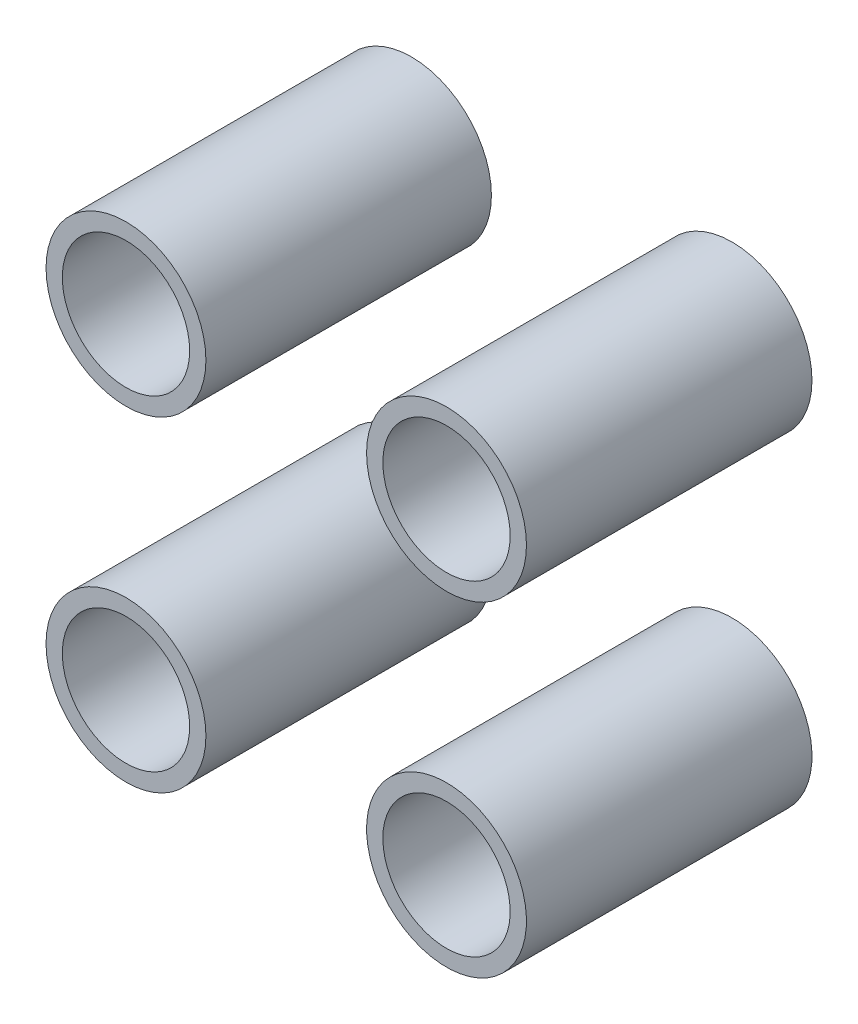
ISO-10303-21;
HEADER;
FILE_DESCRIPTION(('STEP AP214'),'2;1');
FILE_NAME('part.step','',(''),(''),'','','');
FILE_SCHEMA(('AUTOMOTIVE_DESIGN { 1 0 10303 214 1 1 1 1 }'));
ENDSEC;
DATA;
#1=APPLICATION_CONTEXT('core data for automotive mechanical design processes');
#2=APPLICATION_PROTOCOL_DEFINITION('international standard','automotive_design',2000,#1);
#3=PRODUCT_CONTEXT('',#1,'mechanical');
#4=PRODUCT('Part','Part','',(#3));
#5=PRODUCT_RELATED_PRODUCT_CATEGORY('part','',(#4));
#6=PRODUCT_DEFINITION_FORMATION('','',#4);
#7=PRODUCT_DEFINITION_CONTEXT('part definition',#1,'design');
#8=PRODUCT_DEFINITION('design','',#6,#7);
#9=PRODUCT_DEFINITION_SHAPE('','',#8);
#10=(LENGTH_UNIT() NAMED_UNIT(*) SI_UNIT(.MILLI.,.METRE.));
#11=(NAMED_UNIT(*) PLANE_ANGLE_UNIT() SI_UNIT($,.RADIAN.));
#12=(NAMED_UNIT(*) SI_UNIT($,.STERADIAN.) SOLID_ANGLE_UNIT());
#13=UNCERTAINTY_MEASURE_WITH_UNIT(LENGTH_MEASURE(1.E-05),#10,'distance_accuracy_value','');
#14=(GEOMETRIC_REPRESENTATION_CONTEXT(3) GLOBAL_UNCERTAINTY_ASSIGNED_CONTEXT((#13)) GLOBAL_UNIT_ASSIGNED_CONTEXT((#10,
#11,#12)) REPRESENTATION_CONTEXT('',''));
#15=CARTESIAN_POINT('',(0.,0.,0.));
#16=DIRECTION('',(0.,0.,1.));
#17=DIRECTION('',(1.,0.,0.));
#18=AXIS2_PLACEMENT_3D('',#15,#16,#17);
#19=CARTESIAN_POINT('',(28.0668844013724,-28.5,11.5303963476413));
#20=DIRECTION('',(0.,0.,1.));
#21=DIRECTION('',(0.40024567660561,-0.916407877726134,0.));
#22=AXIS2_PLACEMENT_3D('',#19,#20,#21);
#23=PLANE('',#22);
#24=CARTESIAN_POINT('',(28.0668844013724,-28.5,11.5303963476413));
#25=DIRECTION('',(0.,0.,1.));
#26=DIRECTION('',(0.40024567660561,-0.916407877726134,0.));
#27=AXIS2_PLACEMENT_3D('',#24,#25,#26);
#28=CIRCLE('',#27,14.);
#29=CARTESIAN_POINT('',(33.6703238738509,-41.3297102881659,11.5303963476413));
#30=VERTEX_POINT('',#29);
#31=EDGE_CURVE('P0_E10',#30,#30,#28,.T.);
#32=ORIENTED_EDGE('',*,*,#31,.T.);
#33=EDGE_LOOP('',(#32));
#34=FACE_BOUND('',#33,.T.);
#35=CARTESIAN_POINT('',(28.0668844013724,-28.5,11.5303963476413));
#36=DIRECTION('',(0.,0.,1.));
#37=DIRECTION('',(0.40024567660561,-0.916407877726134,0.));
#38=AXIS2_PLACEMENT_3D('',#35,#36,#37);
#39=CIRCLE('',#38,11.15);
#40=CARTESIAN_POINT('',(32.5296236955249,-38.7179478366464,11.5303963476413));
#41=VERTEX_POINT('',#40);
#42=EDGE_CURVE('P0_E26',#41,#41,#39,.T.);
#43=ORIENTED_EDGE('',*,*,#42,.F.);
#44=EDGE_LOOP('',(#43));
#45=FACE_BOUND('',#44,.T.);
#46=ADVANCED_FACE('P0_F15',(#34,#45),#23,.T.);
#47=CARTESIAN_POINT('',(28.0668844013724,-28.5,-38.4696036523587));
#48=DIRECTION('',(0.,0.,1.));
#49=DIRECTION('',(0.40024567660561,-0.916407877726134,0.));
#50=AXIS2_PLACEMENT_3D('',#47,#48,#49);
#51=PLANE('',#50);
#52=CARTESIAN_POINT('',(28.0668844013724,-28.5,-38.4696036523587));
#53=DIRECTION('',(0.,0.,1.));
#54=DIRECTION('',(0.40024567660561,-0.916407877726134,0.));
#55=AXIS2_PLACEMENT_3D('',#52,#53,#54);
#56=CIRCLE('',#55,14.);
#57=CARTESIAN_POINT('',(33.6703238738509,-41.3297102881659,-38.4696036523587));
#58=VERTEX_POINT('',#57);
#59=EDGE_CURVE('P0_E19',#58,#58,#56,.T.);
#60=ORIENTED_EDGE('',*,*,#59,.F.);
#61=EDGE_LOOP('',(#60));
#62=FACE_BOUND('',#61,.T.);
#63=CARTESIAN_POINT('',(28.0668844013724,-28.5,-38.4696036523587));
#64=DIRECTION('',(0.,0.,1.));
#65=DIRECTION('',(0.40024567660561,-0.916407877726134,0.));
#66=AXIS2_PLACEMENT_3D('',#63,#64,#65);
#67=CIRCLE('',#66,11.15);
#68=CARTESIAN_POINT('',(32.5296236955249,-38.7179478366464,-38.4696036523587));
#69=VERTEX_POINT('',#68);
#70=EDGE_CURVE('P0_E28',#69,#69,#67,.T.);
#71=ORIENTED_EDGE('',*,*,#70,.T.);
#72=EDGE_LOOP('',(#71));
#73=FACE_BOUND('',#72,.T.);
#74=ADVANCED_FACE('P0_F38',(#62,#73),#51,.F.);
#75=CARTESIAN_POINT('',(28.0668844013724,-28.5,11.5303963476413));
#76=DIRECTION('',(0.,0.,-1.));
#77=DIRECTION('',(-0.40024567660561,0.916407877726134,0.));
#78=AXIS2_PLACEMENT_3D('',#75,#76,#77);
#79=CYLINDRICAL_SURFACE('',#78,14.);
#80=ORIENTED_EDGE('',*,*,#31,.F.);
#81=EDGE_LOOP('',(#80));
#82=FACE_BOUND('',#81,.T.);
#83=ORIENTED_EDGE('',*,*,#59,.T.);
#84=EDGE_LOOP('',(#83));
#85=FACE_BOUND('',#84,.T.);
#86=ADVANCED_FACE('P0_F17',(#82,#85),#79,.T.);
#87=CARTESIAN_POINT('',(28.0668844013724,-28.5,11.5303963476413));
#88=DIRECTION('',(0.,0.,-1.));
#89=DIRECTION('',(-0.40024567660561,0.916407877726134,0.));
#90=AXIS2_PLACEMENT_3D('',#87,#88,#89);
#91=CYLINDRICAL_SURFACE('',#90,11.15);
#92=ORIENTED_EDGE('',*,*,#42,.T.);
#93=EDGE_LOOP('',(#92));
#94=FACE_BOUND('',#93,.T.);
#95=ORIENTED_EDGE('',*,*,#70,.F.);
#96=EDGE_LOOP('',(#95));
#97=FACE_BOUND('',#96,.T.);
#98=ADVANCED_FACE('P0_F34',(#94,#97),#91,.F.);
#99=CLOSED_SHELL('',(#46,#74,#86,#98));
#100=MANIFOLD_SOLID_BREP('P0_B1',#99);
#101=CARTESIAN_POINT('',(-28.0668844013724,-28.5,11.5303963476413));
#102=DIRECTION('',(0.,0.,1.));
#103=DIRECTION('',(1.,0.,0.));
#104=AXIS2_PLACEMENT_3D('',#101,#102,#103);
#105=PLANE('',#104);
#106=CARTESIAN_POINT('',(-28.0668844013724,-28.5,11.5303963476413));
#107=DIRECTION('',(0.,0.,1.));
#108=DIRECTION('',(1.,0.,0.));
#109=AXIS2_PLACEMENT_3D('',#106,#107,#108);
#110=CIRCLE('',#109,14.);
#111=CARTESIAN_POINT('',(-14.0668844013724,-28.5,11.5303963476413));
#112=VERTEX_POINT('',#111);
#113=EDGE_CURVE('P1_E9',#112,#112,#110,.T.);
#114=ORIENTED_EDGE('',*,*,#113,.T.);
#115=EDGE_LOOP('',(#114));
#116=FACE_BOUND('',#115,.T.);
#117=CARTESIAN_POINT('',(-28.0668844013724,-28.5,11.5303963476413));
#118=DIRECTION('',(0.,0.,1.));
#119=DIRECTION('',(1.,0.,0.));
#120=AXIS2_PLACEMENT_3D('',#117,#118,#119);
#121=CIRCLE('',#120,11.15);
#122=CARTESIAN_POINT('',(-16.9168844013724,-28.5,11.5303963476413));
#123=VERTEX_POINT('',#122);
#124=EDGE_CURVE('P1_E25',#123,#123,#121,.T.);
#125=ORIENTED_EDGE('',*,*,#124,.F.);
#126=EDGE_LOOP('',(#125));
#127=FACE_BOUND('',#126,.T.);
#128=ADVANCED_FACE('P1_F14',(#116,#127),#105,.T.);
#129=CARTESIAN_POINT('',(-28.0668844013724,-28.5,-38.4696036523587));
#130=DIRECTION('',(0.,0.,1.));
#131=DIRECTION('',(1.,0.,0.));
#132=AXIS2_PLACEMENT_3D('',#129,#130,#131);
#133=PLANE('',#132);
#134=CARTESIAN_POINT('',(-28.0668844013724,-28.5,-38.4696036523587));
#135=DIRECTION('',(0.,0.,1.));
#136=DIRECTION('',(1.,0.,0.));
#137=AXIS2_PLACEMENT_3D('',#134,#135,#136);
#138=CIRCLE('',#137,14.);
#139=CARTESIAN_POINT('',(-14.0668844013724,-28.5,-38.4696036523587));
#140=VERTEX_POINT('',#139);
#141=EDGE_CURVE('P1_E18',#140,#140,#138,.T.);
#142=ORIENTED_EDGE('',*,*,#141,.F.);
#143=EDGE_LOOP('',(#142));
#144=FACE_BOUND('',#143,.T.);
#145=CARTESIAN_POINT('',(-28.0668844013724,-28.5,-38.4696036523587));
#146=DIRECTION('',(0.,0.,1.));
#147=DIRECTION('',(1.,0.,0.));
#148=AXIS2_PLACEMENT_3D('',#145,#146,#147);
#149=CIRCLE('',#148,11.15);
#150=CARTESIAN_POINT('',(-16.9168844013724,-28.5,-38.4696036523587));
#151=VERTEX_POINT('',#150);
#152=EDGE_CURVE('P1_E27',#151,#151,#149,.T.);
#153=ORIENTED_EDGE('',*,*,#152,.T.);
#154=EDGE_LOOP('',(#153));
#155=FACE_BOUND('',#154,.T.);
#156=ADVANCED_FACE('P1_F37',(#144,#155),#133,.F.);
#157=CARTESIAN_POINT('',(-28.0668844013724,-28.5,11.5303963476413));
#158=DIRECTION('',(0.,0.,-1.));
#159=DIRECTION('',(-1.,0.,0.));
#160=AXIS2_PLACEMENT_3D('',#157,#158,#159);
#161=CYLINDRICAL_SURFACE('',#160,14.);
#162=ORIENTED_EDGE('',*,*,#113,.F.);
#163=EDGE_LOOP('',(#162));
#164=FACE_BOUND('',#163,.T.);
#165=ORIENTED_EDGE('',*,*,#141,.T.);
#166=EDGE_LOOP('',(#165));
#167=FACE_BOUND('',#166,.T.);
#168=ADVANCED_FACE('P1_F16',(#164,#167),#161,.T.);
#169=CARTESIAN_POINT('',(-28.0668844013724,-28.5,11.5303963476413));
#170=DIRECTION('',(0.,0.,-1.));
#171=DIRECTION('',(-1.,0.,0.));
#172=AXIS2_PLACEMENT_3D('',#169,#170,#171);
#173=CYLINDRICAL_SURFACE('',#172,11.15);
#174=ORIENTED_EDGE('',*,*,#124,.T.);
#175=EDGE_LOOP('',(#174));
#176=FACE_BOUND('',#175,.T.);
#177=ORIENTED_EDGE('',*,*,#152,.F.);
#178=EDGE_LOOP('',(#177));
#179=FACE_BOUND('',#178,.T.);
#180=ADVANCED_FACE('P1_F33',(#176,#179),#173,.F.);
#181=CLOSED_SHELL('',(#128,#156,#168,#180));
#182=MANIFOLD_SOLID_BREP('P1_B1',#181);
#183=CARTESIAN_POINT('',(28.0668844013724,28.5,11.5303963476413));
#184=DIRECTION('',(0.,0.,1.));
#185=DIRECTION('',(1.,0.,0.));
#186=AXIS2_PLACEMENT_3D('',#183,#184,#185);
#187=PLANE('',#186);
#188=CARTESIAN_POINT('',(28.0668844013724,28.5,11.5303963476413));
#189=DIRECTION('',(0.,0.,1.));
#190=DIRECTION('',(1.,0.,0.));
#191=AXIS2_PLACEMENT_3D('',#188,#189,#190);
#192=CIRCLE('',#191,14.);
#193=CARTESIAN_POINT('',(42.0668844013724,28.5,11.5303963476413));
#194=VERTEX_POINT('',#193);
#195=EDGE_CURVE('P2_E10',#194,#194,#192,.T.);
#196=ORIENTED_EDGE('',*,*,#195,.T.);
#197=EDGE_LOOP('',(#196));
#198=FACE_BOUND('',#197,.T.);
#199=CARTESIAN_POINT('',(28.0668844013724,28.5,11.5303963476413));
#200=DIRECTION('',(0.,0.,1.));
#201=DIRECTION('',(1.,0.,0.));
#202=AXIS2_PLACEMENT_3D('',#199,#200,#201);
#203=CIRCLE('',#202,11.15);
#204=CARTESIAN_POINT('',(39.2168844013724,28.5,11.5303963476413));
#205=VERTEX_POINT('',#204);
#206=EDGE_CURVE('P2_E29',#205,#205,#203,.T.);
#207=ORIENTED_EDGE('',*,*,#206,.F.);
#208=EDGE_LOOP('',(#207));
#209=FACE_BOUND('',#208,.T.);
#210=ADVANCED_FACE('P2_F15',(#198,#209),#187,.T.);
#211=CARTESIAN_POINT('',(28.0668844013724,28.5,-38.4696036523587));
#212=DIRECTION('',(0.,0.,1.));
#213=DIRECTION('',(1.,0.,0.));
#214=AXIS2_PLACEMENT_3D('',#211,#212,#213);
#215=PLANE('',#214);
#216=CARTESIAN_POINT('',(28.0668844013724,28.5,-38.4696036523587));
#217=DIRECTION('',(0.,0.,1.));
#218=DIRECTION('',(1.,0.,0.));
#219=AXIS2_PLACEMENT_3D('',#216,#217,#218);
#220=CIRCLE('',#219,14.);
#221=CARTESIAN_POINT('',(42.0668844013724,28.5,-38.4696036523587));
#222=VERTEX_POINT('',#221);
#223=EDGE_CURVE('P2_E19',#222,#222,#220,.T.);
#224=ORIENTED_EDGE('',*,*,#223,.F.);
#225=EDGE_LOOP('',(#224));
#226=FACE_BOUND('',#225,.T.);
#227=CARTESIAN_POINT('',(28.0668844013724,28.5,-38.4696036523587));
#228=DIRECTION('',(0.,0.,1.));
#229=DIRECTION('',(1.,0.,0.));
#230=AXIS2_PLACEMENT_3D('',#227,#228,#229);
#231=CIRCLE('',#230,11.15);
#232=CARTESIAN_POINT('',(39.2168844013724,28.5,-38.4696036523587));
#233=VERTEX_POINT('',#232);
#234=EDGE_CURVE('P2_E31',#233,#233,#231,.T.);
#235=ORIENTED_EDGE('',*,*,#234,.T.);
#236=EDGE_LOOP('',(#235));
#237=FACE_BOUND('',#236,.T.);
#238=ADVANCED_FACE('P2_F43',(#226,#237),#215,.F.);
#239=CARTESIAN_POINT('',(28.0668844013724,28.5,11.5303963476413));
#240=DIRECTION('',(0.,0.,-1.));
#241=DIRECTION('',(-1.,0.,0.));
#242=AXIS2_PLACEMENT_3D('',#239,#240,#241);
#243=CYLINDRICAL_SURFACE('',#242,14.);
#244=ORIENTED_EDGE('',*,*,#195,.F.);
#245=EDGE_LOOP('',(#244));
#246=FACE_BOUND('',#245,.T.);
#247=ORIENTED_EDGE('',*,*,#223,.T.);
#248=EDGE_LOOP('',(#247));
#249=FACE_BOUND('',#248,.T.);
#250=ADVANCED_FACE('P2_F17',(#246,#249),#243,.T.);
#251=CARTESIAN_POINT('',(28.0668844013724,28.5,11.5303963476413));
#252=DIRECTION('',(0.,0.,-1.));
#253=DIRECTION('',(-1.,0.,0.));
#254=AXIS2_PLACEMENT_3D('',#251,#252,#253);
#255=CYLINDRICAL_SURFACE('',#254,11.15);
#256=ORIENTED_EDGE('',*,*,#206,.T.);
#257=EDGE_LOOP('',(#256));
#258=FACE_BOUND('',#257,.T.);
#259=ORIENTED_EDGE('',*,*,#234,.F.);
#260=EDGE_LOOP('',(#259));
#261=FACE_BOUND('',#260,.T.);
#262=ADVANCED_FACE('P2_F39',(#258,#261),#255,.F.);
#263=CLOSED_SHELL('',(#210,#238,#250,#262));
#264=MANIFOLD_SOLID_BREP('P2_B1',#263);
#265=CARTESIAN_POINT('',(-28.0668844013724,28.5,11.5303963476413));
#266=DIRECTION('',(0.,0.,1.));
#267=DIRECTION('',(1.,0.,0.));
#268=AXIS2_PLACEMENT_3D('',#265,#266,#267);
#269=PLANE('',#268);
#270=CARTESIAN_POINT('',(-28.0668844013724,28.5,11.5303963476413));
#271=DIRECTION('',(0.,0.,1.));
#272=DIRECTION('',(1.,0.,0.));
#273=AXIS2_PLACEMENT_3D('',#270,#271,#272);
#274=CIRCLE('',#273,14.);
#275=CARTESIAN_POINT('',(-14.0668844013724,28.5,11.5303963476413));
#276=VERTEX_POINT('',#275);
#277=EDGE_CURVE('P3_E10',#276,#276,#274,.T.);
#278=ORIENTED_EDGE('',*,*,#277,.T.);
#279=EDGE_LOOP('',(#278));
#280=FACE_BOUND('',#279,.T.);
#281=CARTESIAN_POINT('',(-28.0668844013724,28.5,11.5303963476413));
#282=DIRECTION('',(0.,0.,1.));
#283=DIRECTION('',(1.,0.,0.));
#284=AXIS2_PLACEMENT_3D('',#281,#282,#283);
#285=CIRCLE('',#284,11.15);
#286=CARTESIAN_POINT('',(-16.9168844013724,28.5,11.5303963476413));
#287=VERTEX_POINT('',#286);
#288=EDGE_CURVE('P3_E26',#287,#287,#285,.T.);
#289=ORIENTED_EDGE('',*,*,#288,.F.);
#290=EDGE_LOOP('',(#289));
#291=FACE_BOUND('',#290,.T.);
#292=ADVANCED_FACE('P3_F15',(#280,#291),#269,.T.);
#293=CARTESIAN_POINT('',(-28.0668844013724,28.5,-38.4696036523587));
#294=DIRECTION('',(0.,0.,1.));
#295=DIRECTION('',(1.,0.,0.));
#296=AXIS2_PLACEMENT_3D('',#293,#294,#295);
#297=PLANE('',#296);
#298=CARTESIAN_POINT('',(-28.0668844013724,28.5,-38.4696036523587));
#299=DIRECTION('',(0.,0.,1.));
#300=DIRECTION('',(1.,0.,0.));
#301=AXIS2_PLACEMENT_3D('',#298,#299,#300);
#302=CIRCLE('',#301,14.);
#303=CARTESIAN_POINT('',(-14.0668844013724,28.5,-38.4696036523587));
#304=VERTEX_POINT('',#303);
#305=EDGE_CURVE('P3_E19',#304,#304,#302,.T.);
#306=ORIENTED_EDGE('',*,*,#305,.F.);
#307=EDGE_LOOP('',(#306));
#308=FACE_BOUND('',#307,.T.);
#309=CARTESIAN_POINT('',(-28.0668844013724,28.5,-38.4696036523587));
#310=DIRECTION('',(0.,0.,1.));
#311=DIRECTION('',(1.,0.,0.));
#312=AXIS2_PLACEMENT_3D('',#309,#310,#311);
#313=CIRCLE('',#312,11.15);
#314=CARTESIAN_POINT('',(-16.9168844013724,28.5,-38.4696036523587));
#315=VERTEX_POINT('',#314);
#316=EDGE_CURVE('P3_E28',#315,#315,#313,.T.);
#317=ORIENTED_EDGE('',*,*,#316,.T.);
#318=EDGE_LOOP('',(#317));
#319=FACE_BOUND('',#318,.T.);
#320=ADVANCED_FACE('P3_F38',(#308,#319),#297,.F.);
#321=CARTESIAN_POINT('',(-28.0668844013724,28.5,11.5303963476413));
#322=DIRECTION('',(0.,0.,-1.));
#323=DIRECTION('',(-1.,0.,0.));
#324=AXIS2_PLACEMENT_3D('',#321,#322,#323);
#325=CYLINDRICAL_SURFACE('',#324,14.);
#326=ORIENTED_EDGE('',*,*,#277,.F.);
#327=EDGE_LOOP('',(#326));
#328=FACE_BOUND('',#327,.T.);
#329=ORIENTED_EDGE('',*,*,#305,.T.);
#330=EDGE_LOOP('',(#329));
#331=FACE_BOUND('',#330,.T.);
#332=ADVANCED_FACE('P3_F17',(#328,#331),#325,.T.);
#333=CARTESIAN_POINT('',(-28.0668844013724,28.5,11.5303963476413));
#334=DIRECTION('',(0.,0.,-1.));
#335=DIRECTION('',(-1.,0.,0.));
#336=AXIS2_PLACEMENT_3D('',#333,#334,#335);
#337=CYLINDRICAL_SURFACE('',#336,11.15);
#338=ORIENTED_EDGE('',*,*,#288,.T.);
#339=EDGE_LOOP('',(#338));
#340=FACE_BOUND('',#339,.T.);
#341=ORIENTED_EDGE('',*,*,#316,.F.);
#342=EDGE_LOOP('',(#341));
#343=FACE_BOUND('',#342,.T.);
#344=ADVANCED_FACE('P3_F34',(#340,#343),#337,.F.);
#345=CLOSED_SHELL('',(#292,#320,#332,#344));
#346=MANIFOLD_SOLID_BREP('P3_B1',#345);
#347=ADVANCED_BREP_SHAPE_REPRESENTATION('',(#18,#100,#182,#264,#346),#14);
#348=SHAPE_DEFINITION_REPRESENTATION(#9,#347);
ENDSEC;
END-ISO-10303-21;
